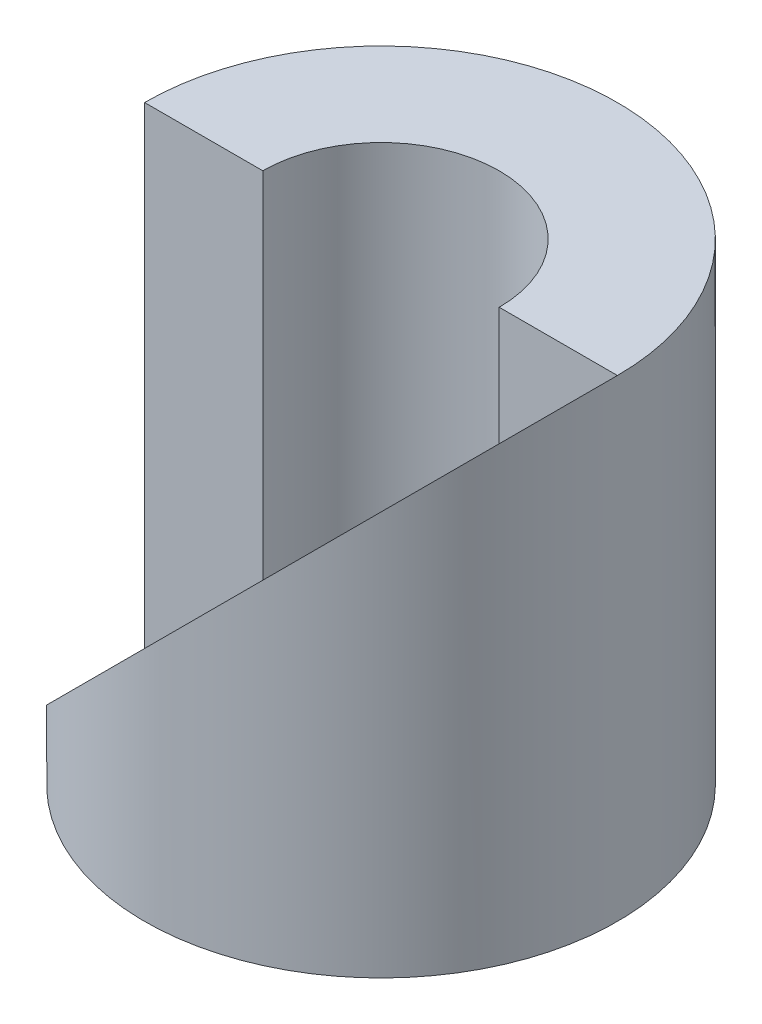
ISO-10303-21;
HEADER;
FILE_DESCRIPTION(('STEP AP214'),'2;1');
FILE_NAME('part.step','',(''),(''),'','','');
FILE_SCHEMA(('AUTOMOTIVE_DESIGN { 1 0 10303 214 1 1 1 1 }'));
ENDSEC;
DATA;
#1=APPLICATION_CONTEXT('core data for automotive mechanical design processes');
#2=APPLICATION_PROTOCOL_DEFINITION('international standard','automotive_design',2000,#1);
#3=PRODUCT_CONTEXT('',#1,'mechanical');
#4=PRODUCT('Part','Part','',(#3));
#5=PRODUCT_RELATED_PRODUCT_CATEGORY('part','',(#4));
#6=PRODUCT_DEFINITION_FORMATION('','',#4);
#7=PRODUCT_DEFINITION_CONTEXT('part definition',#1,'design');
#8=PRODUCT_DEFINITION('design','',#6,#7);
#9=PRODUCT_DEFINITION_SHAPE('','',#8);
#10=(LENGTH_UNIT() NAMED_UNIT(*) SI_UNIT(.MILLI.,.METRE.));
#11=(NAMED_UNIT(*) PLANE_ANGLE_UNIT() SI_UNIT($,.RADIAN.));
#12=(NAMED_UNIT(*) SI_UNIT($,.STERADIAN.) SOLID_ANGLE_UNIT());
#13=UNCERTAINTY_MEASURE_WITH_UNIT(LENGTH_MEASURE(1.E-05),#10,'distance_accuracy_value','');
#14=(GEOMETRIC_REPRESENTATION_CONTEXT(3) GLOBAL_UNCERTAINTY_ASSIGNED_CONTEXT((#13)) GLOBAL_UNIT_ASSIGNED_CONTEXT((#10,
#11,#12)) REPRESENTATION_CONTEXT('',''));
#15=CARTESIAN_POINT('',(0.,0.,0.));
#16=DIRECTION('',(0.,0.,1.));
#17=DIRECTION('',(1.,0.,0.));
#18=AXIS2_PLACEMENT_3D('',#15,#16,#17);
#19=CARTESIAN_POINT('',(0.,20.,0.));
#20=DIRECTION('',(0.,1.,0.));
#21=DIRECTION('',(-1.,0.,0.));
#22=AXIS2_PLACEMENT_3D('',#19,#20,#21);
#23=PLANE('',#22);
#24=CARTESIAN_POINT('',(0.,20.,0.));
#25=DIRECTION('',(0.,-1.,0.));
#26=DIRECTION('',(1.,0.,0.));
#27=AXIS2_PLACEMENT_3D('',#24,#25,#26);
#28=CIRCLE('',#27,10.);
#29=CARTESIAN_POINT('',(-10.,20.,0.));
#30=VERTEX_POINT('',#29);
#31=CARTESIAN_POINT('',(10.,20.,0.));
#32=VERTEX_POINT('',#31);
#33=EDGE_CURVE('E84',#30,#32,#28,.T.);
#34=ORIENTED_EDGE('',*,*,#33,.F.);
#35=DIRECTION('',(-1.,0.,0.));
#36=VECTOR('',#35,1.);
#37=CARTESIAN_POINT('',(-10.,20.,0.));
#38=LINE('',#37,#36);
#39=CARTESIAN_POINT('',(-5.,20.,0.));
#40=VERTEX_POINT('',#39);
#41=EDGE_CURVE('E68',#40,#30,#38,.T.);
#42=ORIENTED_EDGE('',*,*,#41,.F.);
#43=CARTESIAN_POINT('',(0.,20.,0.));
#44=DIRECTION('',(0.,1.,0.));
#45=DIRECTION('',(-1.,0.,0.));
#46=AXIS2_PLACEMENT_3D('',#43,#44,#45);
#47=CIRCLE('',#46,5.);
#48=CARTESIAN_POINT('',(5.,20.,0.));
#49=VERTEX_POINT('',#48);
#50=EDGE_CURVE('E100',#49,#40,#47,.T.);
#51=ORIENTED_EDGE('',*,*,#50,.F.);
#52=EDGE_CURVE('E78',#32,#49,#38,.T.);
#53=ORIENTED_EDGE('',*,*,#52,.F.);
#54=EDGE_LOOP('',(#34,#42,#51,#53));
#55=FACE_BOUND('',#54,.T.);
#56=ADVANCED_FACE('F33',(#55),#23,.T.);
#57=CARTESIAN_POINT('',(0.,0.,0.));
#58=DIRECTION('',(0.,-1.,0.));
#59=DIRECTION('',(1.,0.,0.));
#60=AXIS2_PLACEMENT_3D('',#57,#58,#59);
#61=CYLINDRICAL_SURFACE('',#60,10.);
#62=ORIENTED_EDGE('',*,*,#33,.T.);
#63=CARTESIAN_POINT('',(0.,10.,0.));
#64=DIRECTION('',(-0.707106781186548,0.707106781186547,0.));
#65=DIRECTION('',(-0.707106781186547,-0.707106781186548,0.));
#66=AXIS2_PLACEMENT_3D('',#63,#64,#65);
#67=ELLIPSE('',#66,14.1421356237309,10.);
#68=CARTESIAN_POINT('',(-10.,0.,0.));
#69=VERTEX_POINT('',#68);
#70=EDGE_CURVE('E101',#32,#69,#67,.F.);
#71=ORIENTED_EDGE('',*,*,#70,.T.);
#72=CARTESIAN_POINT('',(0.,0.,0.));
#73=DIRECTION('',(0.,-1.,0.));
#74=DIRECTION('',(1.,0.,0.));
#75=AXIS2_PLACEMENT_3D('',#72,#73,#74);
#76=CIRCLE('',#75,10.);
#77=EDGE_CURVE('E86',#69,#69,#76,.T.);
#78=ORIENTED_EDGE('',*,*,#77,.F.);
#79=DIRECTION('',(0.,-1.,0.));
#80=VECTOR('',#79,1.);
#81=CARTESIAN_POINT('',(-10.,0.,0.));
#82=LINE('',#81,#80);
#83=EDGE_CURVE('E71',#30,#69,#82,.T.);
#84=ORIENTED_EDGE('',*,*,#83,.F.);
#85=EDGE_LOOP('',(#62,#71,#78,#84));
#86=FACE_BOUND('',#85,.T.);
#87=ADVANCED_FACE('F83',(#86),#61,.T.);
#88=CARTESIAN_POINT('',(0.,0.,0.));
#89=DIRECTION('',(0.,1.,0.));
#90=DIRECTION('',(-1.,0.,0.));
#91=AXIS2_PLACEMENT_3D('',#88,#89,#90);
#92=CYLINDRICAL_SURFACE('',#91,5.);
#93=CARTESIAN_POINT('',(0.,0.,0.));
#94=DIRECTION('',(0.,1.,0.));
#95=DIRECTION('',(-1.,0.,0.));
#96=AXIS2_PLACEMENT_3D('',#93,#94,#95);
#97=CIRCLE('',#96,5.);
#98=CARTESIAN_POINT('',(-5.,0.,0.));
#99=VERTEX_POINT('',#98);
#100=EDGE_CURVE('E92',#99,#99,#97,.T.);
#101=ORIENTED_EDGE('',*,*,#100,.F.);
#102=EDGE_LOOP('',(#101));
#103=FACE_BOUND('',#102,.T.);
#104=DIRECTION('',(0.,1.,0.));
#105=VECTOR('',#104,1.);
#106=CARTESIAN_POINT('',(5.,0.,0.));
#107=LINE('',#106,#105);
#108=CARTESIAN_POINT('',(5.,15.,0.));
#109=VERTEX_POINT('',#108);
#110=EDGE_CURVE('E11',#49,#109,#107,.F.);
#111=ORIENTED_EDGE('',*,*,#110,.F.);
#112=ORIENTED_EDGE('',*,*,#50,.T.);
#113=DIRECTION('',(0.,1.,0.));
#114=VECTOR('',#113,1.);
#115=CARTESIAN_POINT('',(-5.,0.,0.));
#116=LINE('',#115,#114);
#117=CARTESIAN_POINT('',(-5.,5.,0.));
#118=VERTEX_POINT('',#117);
#119=EDGE_CURVE('E73',#118,#40,#116,.T.);
#120=ORIENTED_EDGE('',*,*,#119,.F.);
#121=CARTESIAN_POINT('',(0.,10.,0.));
#122=DIRECTION('',(-0.707106781186548,0.707106781186547,0.));
#123=DIRECTION('',(0.707106781186547,0.707106781186548,0.));
#124=AXIS2_PLACEMENT_3D('',#121,#122,#123);
#125=ELLIPSE('',#124,7.07106781186547,5.);
#126=EDGE_CURVE('E40',#109,#118,#125,.F.);
#127=ORIENTED_EDGE('',*,*,#126,.F.);
#128=EDGE_LOOP('',(#111,#112,#120,#127));
#129=FACE_BOUND('',#128,.T.);
#130=ADVANCED_FACE('F99',(#103,#129),#92,.F.);
#131=CARTESIAN_POINT('',(0.,0.,0.));
#132=DIRECTION('',(0.,-1.,0.));
#133=DIRECTION('',(1.,0.,0.));
#134=AXIS2_PLACEMENT_3D('',#131,#132,#133);
#135=PLANE('',#134);
#136=ORIENTED_EDGE('',*,*,#100,.T.);
#137=EDGE_LOOP('',(#136));
#138=FACE_BOUND('',#137,.T.);
#139=ORIENTED_EDGE('',*,*,#77,.T.);
#140=EDGE_LOOP('',(#139));
#141=FACE_BOUND('',#140,.T.);
#142=ADVANCED_FACE('F113',(#138,#141),#135,.T.);
#143=CARTESIAN_POINT('',(10.,20.,10.));
#144=DIRECTION('',(-0.707106781186548,0.707106781186547,0.));
#145=DIRECTION('',(-0.707106781186547,-0.707106781186548,0.));
#146=AXIS2_PLACEMENT_3D('',#143,#144,#145);
#147=PLANE('',#146);
#148=DIRECTION('',(0.707106781186547,0.707106781186548,0.));
#149=VECTOR('',#148,1.);
#150=CARTESIAN_POINT('',(10.,20.,0.));
#151=LINE('',#150,#149);
#152=EDGE_CURVE('E87',#109,#32,#151,.T.);
#153=ORIENTED_EDGE('',*,*,#152,.F.);
#154=ORIENTED_EDGE('',*,*,#126,.T.);
#155=EDGE_CURVE('E47',#69,#118,#151,.T.);
#156=ORIENTED_EDGE('',*,*,#155,.F.);
#157=ORIENTED_EDGE('',*,*,#70,.F.);
#158=EDGE_LOOP('',(#153,#154,#156,#157));
#159=FACE_BOUND('',#158,.T.);
#160=ADVANCED_FACE('F97',(#159),#147,.T.);
#161=CARTESIAN_POINT('',(0.,0.,0.));
#162=DIRECTION('',(0.,0.,1.));
#163=DIRECTION('',(1.,0.,0.));
#164=AXIS2_PLACEMENT_3D('',#161,#162,#163);
#165=PLANE('',#164);
#166=ORIENTED_EDGE('',*,*,#110,.T.);
#167=ORIENTED_EDGE('',*,*,#152,.T.);
#168=ORIENTED_EDGE('',*,*,#52,.T.);
#169=EDGE_LOOP('',(#166,#167,#168));
#170=FACE_BOUND('',#169,.T.);
#171=ADVANCED_FACE('F106',(#170),#165,.T.);
#172=ORIENTED_EDGE('',*,*,#119,.T.);
#173=ORIENTED_EDGE('',*,*,#41,.T.);
#174=ORIENTED_EDGE('',*,*,#83,.T.);
#175=ORIENTED_EDGE('',*,*,#155,.T.);
#176=EDGE_LOOP('',(#172,#173,#174,#175));
#177=FACE_BOUND('',#176,.T.);
#178=ADVANCED_FACE('F70',(#177),#165,.T.);
#179=CLOSED_SHELL('',(#56,#87,#130,#142,#160,#171,#178));
#180=MANIFOLD_SOLID_BREP('B2',#179);
#181=ADVANCED_BREP_SHAPE_REPRESENTATION('',(#18,#180),#14);
#182=SHAPE_DEFINITION_REPRESENTATION(#9,#181);
ENDSEC;
END-ISO-10303-21;
